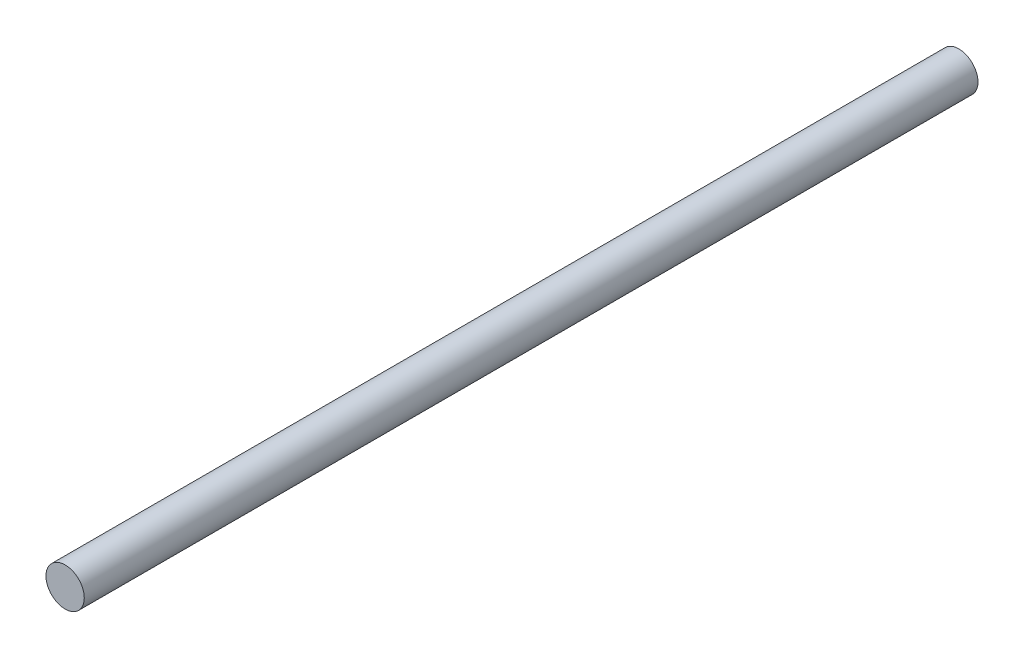
ISO-10303-21;
HEADER;
FILE_DESCRIPTION(('STEP AP214'),'2;1');
FILE_NAME('part.step','',(''),(''),'','','');
FILE_SCHEMA(('AUTOMOTIVE_DESIGN { 1 0 10303 214 1 1 1 1 }'));
ENDSEC;
DATA;
#1=APPLICATION_CONTEXT('core data for automotive mechanical design processes');
#2=APPLICATION_PROTOCOL_DEFINITION('international standard','automotive_design',2000,#1);
#3=PRODUCT_CONTEXT('',#1,'mechanical');
#4=PRODUCT('Part','Part','',(#3));
#5=PRODUCT_RELATED_PRODUCT_CATEGORY('part','',(#4));
#6=PRODUCT_DEFINITION_FORMATION('','',#4);
#7=PRODUCT_DEFINITION_CONTEXT('part definition',#1,'design');
#8=PRODUCT_DEFINITION('design','',#6,#7);
#9=PRODUCT_DEFINITION_SHAPE('','',#8);
#10=(LENGTH_UNIT() NAMED_UNIT(*) SI_UNIT(.MILLI.,.METRE.));
#11=(NAMED_UNIT(*) PLANE_ANGLE_UNIT() SI_UNIT($,.RADIAN.));
#12=(NAMED_UNIT(*) SI_UNIT($,.STERADIAN.) SOLID_ANGLE_UNIT());
#13=UNCERTAINTY_MEASURE_WITH_UNIT(LENGTH_MEASURE(1.E-05),#10,'distance_accuracy_value','');
#14=(GEOMETRIC_REPRESENTATION_CONTEXT(3) GLOBAL_UNCERTAINTY_ASSIGNED_CONTEXT((#13)) GLOBAL_UNIT_ASSIGNED_CONTEXT((#10,
#11,#12)) REPRESENTATION_CONTEXT('',''));
#15=CARTESIAN_POINT('',(0.,0.,0.));
#16=DIRECTION('',(0.,0.,1.));
#17=DIRECTION('',(1.,0.,0.));
#18=AXIS2_PLACEMENT_3D('',#15,#16,#17);
#19=CARTESIAN_POINT('',(0.,0.,70.));
#20=DIRECTION('',(0.,0.,-1.));
#21=DIRECTION('',(-1.,0.,0.));
#22=AXIS2_PLACEMENT_3D('',#19,#20,#21);
#23=CYLINDRICAL_SURFACE('',#22,1.5);
#24=CARTESIAN_POINT('',(0.,0.,70.));
#25=DIRECTION('',(0.,0.,1.));
#26=DIRECTION('',(1.,0.,0.));
#27=AXIS2_PLACEMENT_3D('',#24,#25,#26);
#28=CIRCLE('',#27,1.5);
#29=CARTESIAN_POINT('',(1.5,0.,70.));
#30=VERTEX_POINT('',#29);
#31=EDGE_CURVE('E10',#30,#30,#28,.T.);
#32=ORIENTED_EDGE('',*,*,#31,.F.);
#33=EDGE_LOOP('',(#32));
#34=FACE_BOUND('',#33,.T.);
#35=CARTESIAN_POINT('',(0.,0.,0.));
#36=DIRECTION('',(0.,0.,1.));
#37=DIRECTION('',(1.,0.,0.));
#38=AXIS2_PLACEMENT_3D('',#35,#36,#37);
#39=CIRCLE('',#38,1.5);
#40=CARTESIAN_POINT('',(1.5,0.,0.));
#41=VERTEX_POINT('',#40);
#42=EDGE_CURVE('E38',#41,#41,#39,.T.);
#43=ORIENTED_EDGE('',*,*,#42,.T.);
#44=EDGE_LOOP('',(#43));
#45=FACE_BOUND('',#44,.T.);
#46=ADVANCED_FACE('F35',(#34,#45),#23,.T.);
#47=CARTESIAN_POINT('',(0.,0.,70.));
#48=DIRECTION('',(0.,0.,1.));
#49=DIRECTION('',(1.,0.,0.));
#50=AXIS2_PLACEMENT_3D('',#47,#48,#49);
#51=PLANE('',#50);
#52=ORIENTED_EDGE('',*,*,#31,.T.);
#53=EDGE_LOOP('',(#52));
#54=FACE_BOUND('',#53,.T.);
#55=ADVANCED_FACE('F50',(#54),#51,.T.);
#56=CARTESIAN_POINT('',(0.,0.,0.));
#57=DIRECTION('',(0.,0.,1.));
#58=DIRECTION('',(1.,0.,0.));
#59=AXIS2_PLACEMENT_3D('',#56,#57,#58);
#60=PLANE('',#59);
#61=ORIENTED_EDGE('',*,*,#42,.F.);
#62=EDGE_LOOP('',(#61));
#63=FACE_BOUND('',#62,.T.);
#64=ADVANCED_FACE('F48',(#63),#60,.F.);
#65=CLOSED_SHELL('',(#46,#55,#64));
#66=MANIFOLD_SOLID_BREP('B2',#65);
#67=ADVANCED_BREP_SHAPE_REPRESENTATION('',(#18,#66),#14);
#68=SHAPE_DEFINITION_REPRESENTATION(#9,#67);
ENDSEC;
END-ISO-10303-21;
